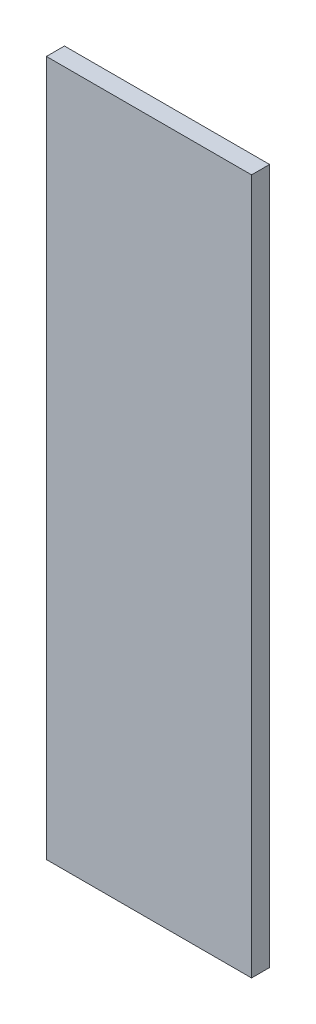
ISO-10303-21;
HEADER;
FILE_DESCRIPTION(('STEP AP214'),'2;1');
FILE_NAME('part.step','',(''),(''),'','','');
FILE_SCHEMA(('AUTOMOTIVE_DESIGN { 1 0 10303 214 1 1 1 1 }'));
ENDSEC;
DATA;
#1=APPLICATION_CONTEXT('core data for automotive mechanical design processes');
#2=APPLICATION_PROTOCOL_DEFINITION('international standard','automotive_design',2000,#1);
#3=PRODUCT_CONTEXT('',#1,'mechanical');
#4=PRODUCT('Part','Part','',(#3));
#5=PRODUCT_RELATED_PRODUCT_CATEGORY('part','',(#4));
#6=PRODUCT_DEFINITION_FORMATION('','',#4);
#7=PRODUCT_DEFINITION_CONTEXT('part definition',#1,'design');
#8=PRODUCT_DEFINITION('design','',#6,#7);
#9=PRODUCT_DEFINITION_SHAPE('','',#8);
#10=(LENGTH_UNIT() NAMED_UNIT(*) SI_UNIT(.MILLI.,.METRE.));
#11=(NAMED_UNIT(*) PLANE_ANGLE_UNIT() SI_UNIT($,.RADIAN.));
#12=(NAMED_UNIT(*) SI_UNIT($,.STERADIAN.) SOLID_ANGLE_UNIT());
#13=UNCERTAINTY_MEASURE_WITH_UNIT(LENGTH_MEASURE(1.E-05),#10,'distance_accuracy_value','');
#14=(GEOMETRIC_REPRESENTATION_CONTEXT(3) GLOBAL_UNCERTAINTY_ASSIGNED_CONTEXT((#13)) GLOBAL_UNIT_ASSIGNED_CONTEXT((#10,
#11,#12)) REPRESENTATION_CONTEXT('',''));
#15=CARTESIAN_POINT('',(0.,0.,0.));
#16=DIRECTION('',(0.,0.,1.));
#17=DIRECTION('',(1.,0.,0.));
#18=AXIS2_PLACEMENT_3D('',#15,#16,#17);
#19=CARTESIAN_POINT('',(0.62500002,2.11916772,0.10999978));
#20=DIRECTION('',(0.,0.,1.));
#21=DIRECTION('',(1.,0.,0.));
#22=AXIS2_PLACEMENT_3D('',#19,#20,#21);
#23=PLANE('',#22);
#24=DIRECTION('',(1.,0.,0.));
#25=VECTOR('',#24,1.);
#26=CARTESIAN_POINT('',(-0.62500002,2.11916772,0.10999978));
#27=LINE('',#26,#25);
#28=CARTESIAN_POINT('',(-0.62500002,2.11916772,0.10999978));
#29=VERTEX_POINT('',#28);
#30=CARTESIAN_POINT('',(0.62500002,2.11916772,0.10999978));
#31=VERTEX_POINT('',#30);
#32=EDGE_CURVE('E27',#29,#31,#27,.T.);
#33=ORIENTED_EDGE('',*,*,#32,.F.);
#34=DIRECTION('',(0.,1.,0.));
#35=VECTOR('',#34,1.);
#36=CARTESIAN_POINT('',(-0.62500002,-2.11916518,0.10999978));
#37=LINE('',#36,#35);
#38=CARTESIAN_POINT('',(-0.62500002,-2.11916518,0.10999978));
#39=VERTEX_POINT('',#38);
#40=EDGE_CURVE('E108',#39,#29,#37,.T.);
#41=ORIENTED_EDGE('',*,*,#40,.F.);
#42=DIRECTION('',(-1.,0.,0.));
#43=VECTOR('',#42,1.);
#44=CARTESIAN_POINT('',(0.62500002,-2.11916518,0.10999978));
#45=LINE('',#44,#43);
#46=CARTESIAN_POINT('',(0.62500002,-2.11916518,0.10999978));
#47=VERTEX_POINT('',#46);
#48=EDGE_CURVE('E20',#47,#39,#45,.T.);
#49=ORIENTED_EDGE('',*,*,#48,.F.);
#50=DIRECTION('',(0.,-1.,0.));
#51=VECTOR('',#50,1.);
#52=CARTESIAN_POINT('',(0.62500002,2.11916772,0.10999978));
#53=LINE('',#52,#51);
#54=EDGE_CURVE('E91',#31,#47,#53,.T.);
#55=ORIENTED_EDGE('',*,*,#54,.F.);
#56=EDGE_LOOP('',(#33,#41,#49,#55));
#57=FACE_BOUND('',#56,.T.);
#58=ADVANCED_FACE('F16',(#57),#23,.T.);
#59=CARTESIAN_POINT('',(0.62500002,2.11916772,0.));
#60=DIRECTION('',(0.,0.,1.));
#61=DIRECTION('',(1.,0.,0.));
#62=AXIS2_PLACEMENT_3D('',#59,#60,#61);
#63=PLANE('',#62);
#64=DIRECTION('',(0.,-1.,0.));
#65=VECTOR('',#64,1.);
#66=CARTESIAN_POINT('',(0.62500002,2.11916772,0.));
#67=LINE('',#66,#65);
#68=CARTESIAN_POINT('',(0.62500002,2.11916772,0.));
#69=VERTEX_POINT('',#68);
#70=CARTESIAN_POINT('',(0.62500002,-2.11916518,0.));
#71=VERTEX_POINT('',#70);
#72=EDGE_CURVE('E77',#69,#71,#67,.T.);
#73=ORIENTED_EDGE('',*,*,#72,.T.);
#74=DIRECTION('',(-1.,0.,0.));
#75=VECTOR('',#74,1.);
#76=CARTESIAN_POINT('',(0.62500002,-2.11916518,0.));
#77=LINE('',#76,#75);
#78=CARTESIAN_POINT('',(-0.62500002,-2.11916518,0.));
#79=VERTEX_POINT('',#78);
#80=EDGE_CURVE('E56',#71,#79,#77,.T.);
#81=ORIENTED_EDGE('',*,*,#80,.T.);
#82=DIRECTION('',(0.,1.,0.));
#83=VECTOR('',#82,1.);
#84=CARTESIAN_POINT('',(-0.62500002,-2.11916518,0.));
#85=LINE('',#84,#83);
#86=CARTESIAN_POINT('',(-0.62500002,2.11916772,0.));
#87=VERTEX_POINT('',#86);
#88=EDGE_CURVE('E80',#79,#87,#85,.T.);
#89=ORIENTED_EDGE('',*,*,#88,.T.);
#90=DIRECTION('',(1.,0.,0.));
#91=VECTOR('',#90,1.);
#92=CARTESIAN_POINT('',(-0.62500002,2.11916772,0.));
#93=LINE('',#92,#91);
#94=EDGE_CURVE('E10',#87,#69,#93,.T.);
#95=ORIENTED_EDGE('',*,*,#94,.T.);
#96=EDGE_LOOP('',(#73,#81,#89,#95));
#97=FACE_BOUND('',#96,.T.);
#98=ADVANCED_FACE('F76',(#97),#63,.F.);
#99=CARTESIAN_POINT('',(-0.62500002,2.11916772,0.));
#100=DIRECTION('',(0.,1.,0.));
#101=DIRECTION('',(1.,0.,0.));
#102=AXIS2_PLACEMENT_3D('',#99,#100,#101);
#103=PLANE('',#102);
#104=DIRECTION('',(0.,0.,1.));
#105=VECTOR('',#104,1.);
#106=CARTESIAN_POINT('',(-0.62500002,2.11916772,0.));
#107=LINE('',#106,#105);
#108=EDGE_CURVE('E102',#87,#29,#107,.T.);
#109=ORIENTED_EDGE('',*,*,#108,.T.);
#110=ORIENTED_EDGE('',*,*,#32,.T.);
#111=DIRECTION('',(0.,0.,1.));
#112=VECTOR('',#111,1.);
#113=CARTESIAN_POINT('',(0.62500002,2.11916772,0.));
#114=LINE('',#113,#112);
#115=EDGE_CURVE('E86',#69,#31,#114,.T.);
#116=ORIENTED_EDGE('',*,*,#115,.F.);
#117=ORIENTED_EDGE('',*,*,#94,.F.);
#118=EDGE_LOOP('',(#109,#110,#116,#117));
#119=FACE_BOUND('',#118,.T.);
#120=ADVANCED_FACE('F18',(#119),#103,.T.);
#121=CARTESIAN_POINT('',(-0.62500002,-2.11916518,0.));
#122=DIRECTION('',(-1.,0.,0.));
#123=DIRECTION('',(0.,0.,1.));
#124=AXIS2_PLACEMENT_3D('',#121,#122,#123);
#125=PLANE('',#124);
#126=DIRECTION('',(0.,0.,1.));
#127=VECTOR('',#126,1.);
#128=CARTESIAN_POINT('',(-0.62500002,-2.11916518,0.));
#129=LINE('',#128,#127);
#130=EDGE_CURVE('E103',#79,#39,#129,.T.);
#131=ORIENTED_EDGE('',*,*,#130,.T.);
#132=ORIENTED_EDGE('',*,*,#40,.T.);
#133=ORIENTED_EDGE('',*,*,#108,.F.);
#134=ORIENTED_EDGE('',*,*,#88,.F.);
#135=EDGE_LOOP('',(#131,#132,#133,#134));
#136=FACE_BOUND('',#135,.T.);
#137=ADVANCED_FACE('F119',(#136),#125,.T.);
#138=CARTESIAN_POINT('',(0.62500002,-2.11916518,0.));
#139=DIRECTION('',(0.,-1.,0.));
#140=DIRECTION('',(0.,0.,-1.));
#141=AXIS2_PLACEMENT_3D('',#138,#139,#140);
#142=PLANE('',#141);
#143=DIRECTION('',(0.,0.,1.));
#144=VECTOR('',#143,1.);
#145=CARTESIAN_POINT('',(0.62500002,-2.11916518,0.));
#146=LINE('',#145,#144);
#147=EDGE_CURVE('E87',#71,#47,#146,.T.);
#148=ORIENTED_EDGE('',*,*,#147,.T.);
#149=ORIENTED_EDGE('',*,*,#48,.T.);
#150=ORIENTED_EDGE('',*,*,#130,.F.);
#151=ORIENTED_EDGE('',*,*,#80,.F.);
#152=EDGE_LOOP('',(#148,#149,#150,#151));
#153=FACE_BOUND('',#152,.T.);
#154=ADVANCED_FACE('F127',(#153),#142,.T.);
#155=CARTESIAN_POINT('',(0.62500002,2.11916772,0.));
#156=DIRECTION('',(1.,0.,0.));
#157=DIRECTION('',(0.,1.,0.));
#158=AXIS2_PLACEMENT_3D('',#155,#156,#157);
#159=PLANE('',#158);
#160=ORIENTED_EDGE('',*,*,#115,.T.);
#161=ORIENTED_EDGE('',*,*,#54,.T.);
#162=ORIENTED_EDGE('',*,*,#147,.F.);
#163=ORIENTED_EDGE('',*,*,#72,.F.);
#164=EDGE_LOOP('',(#160,#161,#162,#163));
#165=FACE_BOUND('',#164,.T.);
#166=ADVANCED_FACE('F84',(#165),#159,.T.);
#167=CLOSED_SHELL('',(#58,#98,#120,#137,#154,#166));
#168=MANIFOLD_SOLID_BREP('B1',#167);
#169=ADVANCED_BREP_SHAPE_REPRESENTATION('',(#18,#168),#14);
#170=SHAPE_DEFINITION_REPRESENTATION(#9,#169);
ENDSEC;
END-ISO-10303-21;
